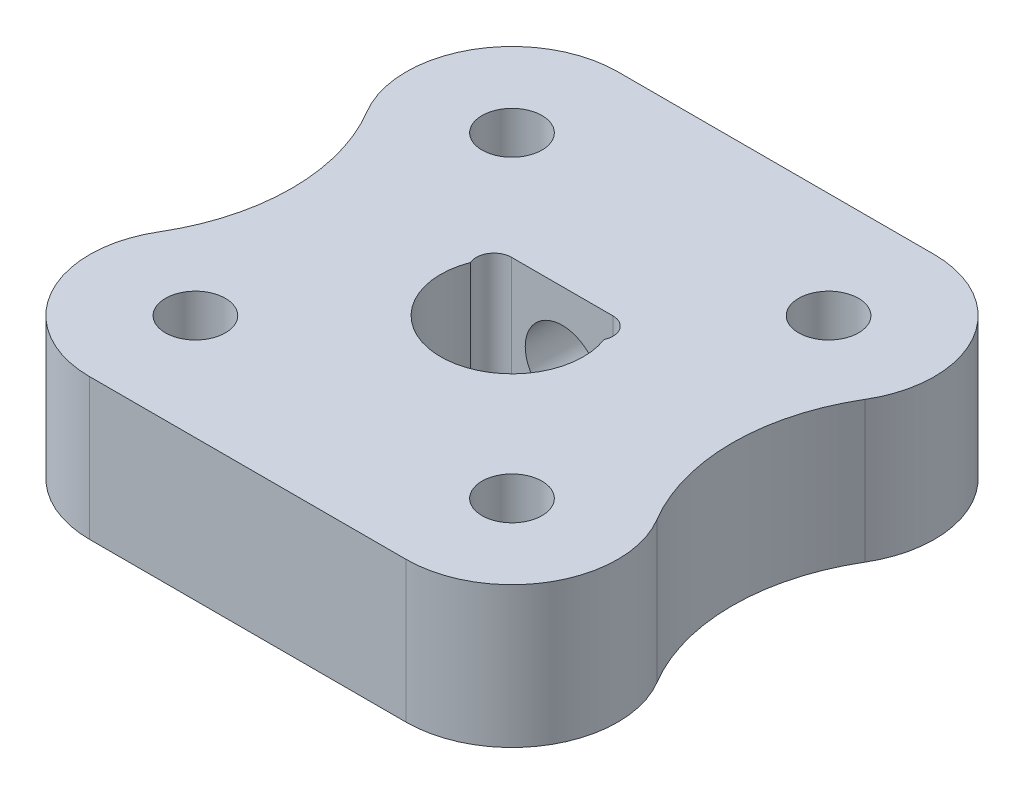
ISO-10303-21;
HEADER;
FILE_DESCRIPTION(('STEP AP214'),'2;1');
FILE_NAME('part.step','',(''),(''),'','','');
FILE_SCHEMA(('AUTOMOTIVE_DESIGN { 1 0 10303 214 1 1 1 1 }'));
ENDSEC;
DATA;
#1=APPLICATION_CONTEXT('core data for automotive mechanical design processes');
#2=APPLICATION_PROTOCOL_DEFINITION('international standard','automotive_design',2000,#1);
#3=PRODUCT_CONTEXT('',#1,'mechanical');
#4=PRODUCT('Part','Part','',(#3));
#5=PRODUCT_RELATED_PRODUCT_CATEGORY('part','',(#4));
#6=PRODUCT_DEFINITION_FORMATION('','',#4);
#7=PRODUCT_DEFINITION_CONTEXT('part definition',#1,'design');
#8=PRODUCT_DEFINITION('design','',#6,#7);
#9=PRODUCT_DEFINITION_SHAPE('','',#8);
#10=(LENGTH_UNIT() NAMED_UNIT(*) SI_UNIT(.MILLI.,.METRE.));
#11=(NAMED_UNIT(*) PLANE_ANGLE_UNIT() SI_UNIT($,.RADIAN.));
#12=(NAMED_UNIT(*) SI_UNIT($,.STERADIAN.) SOLID_ANGLE_UNIT());
#13=UNCERTAINTY_MEASURE_WITH_UNIT(LENGTH_MEASURE(1.E-05),#10,'distance_accuracy_value','');
#14=(GEOMETRIC_REPRESENTATION_CONTEXT(3) GLOBAL_UNCERTAINTY_ASSIGNED_CONTEXT((#13)) GLOBAL_UNIT_ASSIGNED_CONTEXT((#10,
#11,#12)) REPRESENTATION_CONTEXT('',''));
#15=CARTESIAN_POINT('',(0.,0.,0.));
#16=DIRECTION('',(0.,0.,1.));
#17=DIRECTION('',(1.,0.,0.));
#18=AXIS2_PLACEMENT_3D('',#15,#16,#17);
#19=CARTESIAN_POINT('',(11.9987608324787,4.,0.));
#20=DIRECTION('',(0.,-1.,0.));
#21=DIRECTION('',(0.,0.,-1.));
#22=AXIS2_PLACEMENT_3D('',#19,#20,#21);
#23=CYLINDRICAL_SURFACE('',#22,5.74876083247874);
#24=CARTESIAN_POINT('',(11.9987608324787,0.,0.));
#25=DIRECTION('',(0.,1.,0.));
#26=DIRECTION('',(0.,0.,1.));
#27=AXIS2_PLACEMENT_3D('',#24,#25,#26);
#28=CIRCLE('',#27,5.74876083247874);
#29=CARTESIAN_POINT('',(7.06488107380792,0.,2.95043753298049));
#30=VERTEX_POINT('',#29);
#31=CARTESIAN_POINT('',(7.06488107380792,0.,-2.9504375329805));
#32=VERTEX_POINT('',#31);
#33=EDGE_CURVE('E191',#30,#32,#28,.F.);
#34=ORIENTED_EDGE('',*,*,#33,.T.);
#35=DIRECTION('',(0.,-1.,0.));
#36=VECTOR('',#35,1.);
#37=CARTESIAN_POINT('',(7.06488107380792,4.,-2.9504375329805));
#38=LINE('',#37,#36);
#39=CARTESIAN_POINT('',(7.06488107380792,4.,-2.9504375329805));
#40=VERTEX_POINT('',#39);
#41=EDGE_CURVE('E12',#40,#32,#38,.T.);
#42=ORIENTED_EDGE('',*,*,#41,.F.);
#43=CARTESIAN_POINT('',(11.9987608324787,4.,0.));
#44=DIRECTION('',(0.,1.,0.));
#45=DIRECTION('',(0.,0.,1.));
#46=AXIS2_PLACEMENT_3D('',#43,#44,#45);
#47=CIRCLE('',#46,5.74876083247874);
#48=CARTESIAN_POINT('',(7.06488107380792,4.,2.95043753298049));
#49=VERTEX_POINT('',#48);
#50=EDGE_CURVE('E336',#49,#40,#47,.F.);
#51=ORIENTED_EDGE('',*,*,#50,.F.);
#52=DIRECTION('',(0.,-1.,0.));
#53=VECTOR('',#52,1.);
#54=CARTESIAN_POINT('',(7.06488107380792,4.,2.95043753298049));
#55=LINE('',#54,#53);
#56=EDGE_CURVE('E228',#49,#30,#55,.T.);
#57=ORIENTED_EDGE('',*,*,#56,.T.);
#58=EDGE_LOOP('',(#34,#42,#51,#57));
#59=FACE_BOUND('',#58,.T.);
#60=ADVANCED_FACE('F42',(#59),#23,.F.);
#61=CARTESIAN_POINT('',(4.49012806053457,4.,-4.49012806053458));
#62=DIRECTION('',(0.,-1.,0.));
#63=DIRECTION('',(0.,0.,-1.));
#64=AXIS2_PLACEMENT_3D('',#61,#62,#63);
#65=CYLINDRICAL_SURFACE('',#64,3.);
#66=CARTESIAN_POINT('',(4.49012806053457,0.,-4.49012806053458));
#67=DIRECTION('',(0.,1.,0.));
#68=DIRECTION('',(0.,0.,1.));
#69=AXIS2_PLACEMENT_3D('',#66,#67,#68);
#70=CIRCLE('',#69,3.);
#71=CARTESIAN_POINT('',(4.49012806053457,0.,-7.49012806053458));
#72=VERTEX_POINT('',#71);
#73=EDGE_CURVE('E194',#72,#32,#70,.F.);
#74=ORIENTED_EDGE('',*,*,#73,.F.);
#75=DIRECTION('',(0.,-1.,0.));
#76=VECTOR('',#75,1.);
#77=CARTESIAN_POINT('',(4.49012806053457,4.,-7.49012806053458));
#78=LINE('',#77,#76);
#79=CARTESIAN_POINT('',(4.49012806053457,4.,-7.49012806053458));
#80=VERTEX_POINT('',#79);
#81=EDGE_CURVE('E52',#80,#72,#78,.T.);
#82=ORIENTED_EDGE('',*,*,#81,.F.);
#83=CARTESIAN_POINT('',(4.49012806053457,4.,-4.49012806053458));
#84=DIRECTION('',(0.,1.,0.));
#85=DIRECTION('',(0.,0.,1.));
#86=AXIS2_PLACEMENT_3D('',#83,#84,#85);
#87=CIRCLE('',#86,3.);
#88=EDGE_CURVE('E334',#80,#40,#87,.F.);
#89=ORIENTED_EDGE('',*,*,#88,.T.);
#90=ORIENTED_EDGE('',*,*,#41,.T.);
#91=EDGE_LOOP('',(#74,#82,#89,#90));
#92=FACE_BOUND('',#91,.T.);
#93=ADVANCED_FACE('F274',(#92),#65,.T.);
#94=CARTESIAN_POINT('',(0.,4.,-7.49012806053458));
#95=DIRECTION('',(0.,0.,-1.));
#96=DIRECTION('',(-1.,0.,0.));
#97=AXIS2_PLACEMENT_3D('',#94,#95,#96);
#98=PLANE('',#97);
#99=CARTESIAN_POINT('',(0.,2.,-7.49012806053458));
#100=DIRECTION('',(0.,0.,1.));
#101=DIRECTION('',(1.,0.,0.));
#102=AXIS2_PLACEMENT_3D('',#99,#100,#101);
#103=CIRCLE('',#102,1.05);
#104=CARTESIAN_POINT('',(1.05,2.,-7.49012806053458));
#105=VERTEX_POINT('',#104);
#106=EDGE_CURVE('E320',#105,#105,#103,.T.);
#107=ORIENTED_EDGE('',*,*,#106,.T.);
#108=EDGE_LOOP('',(#107));
#109=FACE_BOUND('',#108,.T.);
#110=DIRECTION('',(1.,0.,0.));
#111=VECTOR('',#110,1.);
#112=CARTESIAN_POINT('',(0.,0.,-7.49012806053458));
#113=LINE('',#112,#111);
#114=CARTESIAN_POINT('',(-4.49012806053457,0.,-7.49012806053458));
#115=VERTEX_POINT('',#114);
#116=EDGE_CURVE('E197',#115,#72,#113,.T.);
#117=ORIENTED_EDGE('',*,*,#116,.F.);
#118=DIRECTION('',(0.,-1.,0.));
#119=VECTOR('',#118,1.);
#120=CARTESIAN_POINT('',(-4.49012806053457,4.,-7.49012806053458));
#121=LINE('',#120,#119);
#122=CARTESIAN_POINT('',(-4.49012806053457,4.,-7.49012806053458));
#123=VERTEX_POINT('',#122);
#124=EDGE_CURVE('E234',#123,#115,#121,.T.);
#125=ORIENTED_EDGE('',*,*,#124,.F.);
#126=DIRECTION('',(1.,0.,0.));
#127=VECTOR('',#126,1.);
#128=CARTESIAN_POINT('',(0.,4.,-7.49012806053458));
#129=LINE('',#128,#127);
#130=EDGE_CURVE('E331',#123,#80,#129,.T.);
#131=ORIENTED_EDGE('',*,*,#130,.T.);
#132=ORIENTED_EDGE('',*,*,#81,.T.);
#133=EDGE_LOOP('',(#117,#125,#131,#132));
#134=FACE_BOUND('',#133,.T.);
#135=ADVANCED_FACE('F280',(#109,#134),#98,.T.);
#136=CARTESIAN_POINT('',(-4.49012806053457,4.,-4.49012806053458));
#137=DIRECTION('',(0.,-1.,0.));
#138=DIRECTION('',(0.,0.,-1.));
#139=AXIS2_PLACEMENT_3D('',#136,#137,#138);
#140=CYLINDRICAL_SURFACE('',#139,3.);
#141=CARTESIAN_POINT('',(-4.49012806053457,0.,-4.49012806053458));
#142=DIRECTION('',(0.,1.,0.));
#143=DIRECTION('',(0.,0.,1.));
#144=AXIS2_PLACEMENT_3D('',#141,#142,#143);
#145=CIRCLE('',#144,3.);
#146=CARTESIAN_POINT('',(-7.06488107380792,0.,-2.95043753298049));
#147=VERTEX_POINT('',#146);
#148=EDGE_CURVE('E202',#115,#147,#145,.T.);
#149=ORIENTED_EDGE('',*,*,#148,.T.);
#150=DIRECTION('',(0.,-1.,0.));
#151=VECTOR('',#150,1.);
#152=CARTESIAN_POINT('',(-7.06488107380792,4.,-2.95043753298049));
#153=LINE('',#152,#151);
#154=CARTESIAN_POINT('',(-7.06488107380792,4.,-2.95043753298049));
#155=VERTEX_POINT('',#154);
#156=EDGE_CURVE('E232',#155,#147,#153,.T.);
#157=ORIENTED_EDGE('',*,*,#156,.F.);
#158=CARTESIAN_POINT('',(-4.49012806053457,4.,-4.49012806053458));
#159=DIRECTION('',(0.,1.,0.));
#160=DIRECTION('',(0.,0.,1.));
#161=AXIS2_PLACEMENT_3D('',#158,#159,#160);
#162=CIRCLE('',#161,3.);
#163=EDGE_CURVE('E160',#123,#155,#162,.T.);
#164=ORIENTED_EDGE('',*,*,#163,.F.);
#165=ORIENTED_EDGE('',*,*,#124,.T.);
#166=EDGE_LOOP('',(#149,#157,#164,#165));
#167=FACE_BOUND('',#166,.T.);
#168=ADVANCED_FACE('F309',(#167),#140,.T.);
#169=CARTESIAN_POINT('',(-11.9987608324787,4.,0.));
#170=DIRECTION('',(0.,-1.,0.));
#171=DIRECTION('',(0.,0.,-1.));
#172=AXIS2_PLACEMENT_3D('',#169,#170,#171);
#173=CYLINDRICAL_SURFACE('',#172,5.74876083247874);
#174=CARTESIAN_POINT('',(-11.9987608324787,0.,0.));
#175=DIRECTION('',(0.,1.,0.));
#176=DIRECTION('',(0.,0.,1.));
#177=AXIS2_PLACEMENT_3D('',#174,#175,#176);
#178=CIRCLE('',#177,5.74876083247874);
#179=CARTESIAN_POINT('',(-7.06488107380792,0.,2.95043753298049));
#180=VERTEX_POINT('',#179);
#181=EDGE_CURVE('E205',#180,#147,#178,.T.);
#182=ORIENTED_EDGE('',*,*,#181,.F.);
#183=DIRECTION('',(0.,-1.,0.));
#184=VECTOR('',#183,1.);
#185=CARTESIAN_POINT('',(-7.06488107380792,4.,2.95043753298049));
#186=LINE('',#185,#184);
#187=CARTESIAN_POINT('',(-7.06488107380792,4.,2.95043753298049));
#188=VERTEX_POINT('',#187);
#189=EDGE_CURVE('E148',#188,#180,#186,.T.);
#190=ORIENTED_EDGE('',*,*,#189,.F.);
#191=CARTESIAN_POINT('',(-11.9987608324787,4.,0.));
#192=DIRECTION('',(0.,1.,0.));
#193=DIRECTION('',(0.,0.,1.));
#194=AXIS2_PLACEMENT_3D('',#191,#192,#193);
#195=CIRCLE('',#194,5.74876083247874);
#196=EDGE_CURVE('E158',#188,#155,#195,.T.);
#197=ORIENTED_EDGE('',*,*,#196,.T.);
#198=ORIENTED_EDGE('',*,*,#156,.T.);
#199=EDGE_LOOP('',(#182,#190,#197,#198));
#200=FACE_BOUND('',#199,.T.);
#201=ADVANCED_FACE('F306',(#200),#173,.F.);
#202=CARTESIAN_POINT('',(-4.49012806053457,4.,4.49012806053458));
#203=DIRECTION('',(0.,-1.,0.));
#204=DIRECTION('',(0.,0.,-1.));
#205=AXIS2_PLACEMENT_3D('',#202,#203,#204);
#206=CYLINDRICAL_SURFACE('',#205,3.);
#207=CARTESIAN_POINT('',(-4.49012806053457,0.,4.49012806053458));
#208=DIRECTION('',(0.,1.,0.));
#209=DIRECTION('',(0.,0.,1.));
#210=AXIS2_PLACEMENT_3D('',#207,#208,#209);
#211=CIRCLE('',#210,3.);
#212=CARTESIAN_POINT('',(-4.49012806053457,0.,7.49012806053458));
#213=VERTEX_POINT('',#212);
#214=EDGE_CURVE('E147',#213,#180,#211,.F.);
#215=ORIENTED_EDGE('',*,*,#214,.F.);
#216=DIRECTION('',(0.,-1.,0.));
#217=VECTOR('',#216,1.);
#218=CARTESIAN_POINT('',(-4.49012806053457,4.,7.49012806053458));
#219=LINE('',#218,#217);
#220=CARTESIAN_POINT('',(-4.49012806053457,4.,7.49012806053458));
#221=VERTEX_POINT('',#220);
#222=EDGE_CURVE('E141',#221,#213,#219,.T.);
#223=ORIENTED_EDGE('',*,*,#222,.F.);
#224=CARTESIAN_POINT('',(-4.49012806053457,4.,4.49012806053458));
#225=DIRECTION('',(0.,1.,0.));
#226=DIRECTION('',(0.,0.,1.));
#227=AXIS2_PLACEMENT_3D('',#224,#225,#226);
#228=CIRCLE('',#227,3.);
#229=EDGE_CURVE('E145',#221,#188,#228,.F.);
#230=ORIENTED_EDGE('',*,*,#229,.T.);
#231=ORIENTED_EDGE('',*,*,#189,.T.);
#232=EDGE_LOOP('',(#215,#223,#230,#231));
#233=FACE_BOUND('',#232,.T.);
#234=ADVANCED_FACE('F143',(#233),#206,.T.);
#235=CARTESIAN_POINT('',(0.,4.,7.49012806053458));
#236=DIRECTION('',(0.,0.,-1.));
#237=DIRECTION('',(-1.,0.,0.));
#238=AXIS2_PLACEMENT_3D('',#235,#236,#237);
#239=PLANE('',#238);
#240=DIRECTION('',(1.,0.,0.));
#241=VECTOR('',#240,1.);
#242=CARTESIAN_POINT('',(0.,0.,7.49012806053458));
#243=LINE('',#242,#241);
#244=CARTESIAN_POINT('',(4.49012806053457,0.,7.49012806053458));
#245=VERTEX_POINT('',#244);
#246=EDGE_CURVE('E100',#213,#245,#243,.T.);
#247=ORIENTED_EDGE('',*,*,#246,.T.);
#248=DIRECTION('',(0.,-1.,0.));
#249=VECTOR('',#248,1.);
#250=CARTESIAN_POINT('',(4.49012806053457,4.,7.49012806053458));
#251=LINE('',#250,#249);
#252=CARTESIAN_POINT('',(4.49012806053457,4.,7.49012806053458));
#253=VERTEX_POINT('',#252);
#254=EDGE_CURVE('E149',#253,#245,#251,.T.);
#255=ORIENTED_EDGE('',*,*,#254,.F.);
#256=DIRECTION('',(1.,0.,0.));
#257=VECTOR('',#256,1.);
#258=CARTESIAN_POINT('',(0.,4.,7.49012806053458));
#259=LINE('',#258,#257);
#260=EDGE_CURVE('E151',#221,#253,#259,.T.);
#261=ORIENTED_EDGE('',*,*,#260,.F.);
#262=ORIENTED_EDGE('',*,*,#222,.T.);
#263=EDGE_LOOP('',(#247,#255,#261,#262));
#264=FACE_BOUND('',#263,.T.);
#265=ADVANCED_FACE('F152',(#264),#239,.F.);
#266=CARTESIAN_POINT('',(-1.43874945699382,4.,-0.925));
#267=DIRECTION('',(0.,-1.,0.));
#268=DIRECTION('',(0.,0.,-1.));
#269=AXIS2_PLACEMENT_3D('',#266,#267,#268);
#270=CYLINDRICAL_SURFACE('',#269,0.5);
#271=CARTESIAN_POINT('',(-1.43874945699382,0.,-0.925));
#272=DIRECTION('',(0.,1.,0.));
#273=DIRECTION('',(0.,0.,1.));
#274=AXIS2_PLACEMENT_3D('',#271,#272,#273);
#275=CIRCLE('',#274,0.5);
#276=CARTESIAN_POINT('',(-1.43874945699382,0.,-1.425));
#277=VERTEX_POINT('',#276);
#278=CARTESIAN_POINT('',(-1.8936414023796,0.,-0.717458876308482));
#279=VERTEX_POINT('',#278);
#280=EDGE_CURVE('E178',#277,#279,#275,.T.);
#281=ORIENTED_EDGE('',*,*,#280,.F.);
#282=DIRECTION('',(0.,-1.,0.));
#283=VECTOR('',#282,1.);
#284=CARTESIAN_POINT('',(-1.43874945699382,4.,-1.425));
#285=LINE('',#284,#283);
#286=CARTESIAN_POINT('',(-1.43874945699382,4.,-1.425));
#287=VERTEX_POINT('',#286);
#288=EDGE_CURVE('E46',#287,#277,#285,.T.);
#289=ORIENTED_EDGE('',*,*,#288,.F.);
#290=CARTESIAN_POINT('',(-1.43874945699382,4.,-0.925));
#291=DIRECTION('',(0.,1.,0.));
#292=DIRECTION('',(0.,0.,1.));
#293=AXIS2_PLACEMENT_3D('',#290,#291,#292);
#294=CIRCLE('',#293,0.5);
#295=CARTESIAN_POINT('',(-1.8936414023796,4.,-0.717458876308482));
#296=VERTEX_POINT('',#295);
#297=EDGE_CURVE('E227',#287,#296,#294,.T.);
#298=ORIENTED_EDGE('',*,*,#297,.T.);
#299=DIRECTION('',(0.,-1.,0.));
#300=VECTOR('',#299,1.);
#301=CARTESIAN_POINT('',(-1.8936414023796,4.,-0.717458876308482));
#302=LINE('',#301,#300);
#303=EDGE_CURVE('E177',#296,#279,#302,.T.);
#304=ORIENTED_EDGE('',*,*,#303,.T.);
#305=EDGE_LOOP('',(#281,#289,#298,#304));
#306=FACE_BOUND('',#305,.T.);
#307=ADVANCED_FACE('F44',(#306),#270,.F.);
#308=CARTESIAN_POINT('',(0.,4.,-1.425));
#309=DIRECTION('',(0.,0.,-1.));
#310=DIRECTION('',(-1.,0.,0.));
#311=AXIS2_PLACEMENT_3D('',#308,#309,#310);
#312=PLANE('',#311);
#313=CARTESIAN_POINT('',(0.,2.,-1.425));
#314=DIRECTION('',(0.,0.,-1.));
#315=DIRECTION('',(-1.,0.,0.));
#316=AXIS2_PLACEMENT_3D('',#313,#314,#315);
#317=CIRCLE('',#316,1.05);
#318=CARTESIAN_POINT('',(-1.05,2.,-1.425));
#319=VERTEX_POINT('',#318);
#320=EDGE_CURVE('E182',#319,#319,#317,.T.);
#321=ORIENTED_EDGE('',*,*,#320,.T.);
#322=EDGE_LOOP('',(#321));
#323=FACE_BOUND('',#322,.T.);
#324=DIRECTION('',(1.,0.,0.));
#325=VECTOR('',#324,1.);
#326=CARTESIAN_POINT('',(0.,0.,-1.425));
#327=LINE('',#326,#325);
#328=CARTESIAN_POINT('',(1.43874945699382,0.,-1.425));
#329=VERTEX_POINT('',#328);
#330=EDGE_CURVE('E181',#277,#329,#327,.T.);
#331=ORIENTED_EDGE('',*,*,#330,.T.);
#332=DIRECTION('',(0.,-1.,0.));
#333=VECTOR('',#332,1.);
#334=CARTESIAN_POINT('',(1.43874945699382,4.,-1.425));
#335=LINE('',#334,#333);
#336=CARTESIAN_POINT('',(1.43874945699382,4.,-1.425));
#337=VERTEX_POINT('',#336);
#338=EDGE_CURVE('E239',#337,#329,#335,.T.);
#339=ORIENTED_EDGE('',*,*,#338,.F.);
#340=DIRECTION('',(1.,0.,0.));
#341=VECTOR('',#340,1.);
#342=CARTESIAN_POINT('',(0.,4.,-1.425));
#343=LINE('',#342,#341);
#344=EDGE_CURVE('E248',#287,#337,#343,.T.);
#345=ORIENTED_EDGE('',*,*,#344,.F.);
#346=ORIENTED_EDGE('',*,*,#288,.T.);
#347=EDGE_LOOP('',(#331,#339,#345,#346));
#348=FACE_BOUND('',#347,.T.);
#349=ADVANCED_FACE('F247',(#323,#348),#312,.F.);
#350=CARTESIAN_POINT('',(1.43874945699382,4.,-0.925000000000001));
#351=DIRECTION('',(0.,-1.,0.));
#352=DIRECTION('',(0.,0.,-1.));
#353=AXIS2_PLACEMENT_3D('',#350,#351,#352);
#354=CYLINDRICAL_SURFACE('',#353,0.5);
#355=CARTESIAN_POINT('',(1.43874945699382,0.,-0.925000000000001));
#356=DIRECTION('',(0.,1.,0.));
#357=DIRECTION('',(0.,0.,1.));
#358=AXIS2_PLACEMENT_3D('',#355,#356,#357);
#359=CIRCLE('',#358,0.5);
#360=CARTESIAN_POINT('',(1.8936414023796,0.,-0.717458876308479));
#361=VERTEX_POINT('',#360);
#362=EDGE_CURVE('E185',#329,#361,#359,.F.);
#363=ORIENTED_EDGE('',*,*,#362,.T.);
#364=DIRECTION('',(0.,-1.,0.));
#365=VECTOR('',#364,1.);
#366=CARTESIAN_POINT('',(1.8936414023796,4.,-0.717458876308479));
#367=LINE('',#366,#365);
#368=CARTESIAN_POINT('',(1.8936414023796,4.,-0.717458876308479));
#369=VERTEX_POINT('',#368);
#370=EDGE_CURVE('E238',#369,#361,#367,.T.);
#371=ORIENTED_EDGE('',*,*,#370,.F.);
#372=CARTESIAN_POINT('',(1.43874945699382,4.,-0.925000000000001));
#373=DIRECTION('',(0.,1.,0.));
#374=DIRECTION('',(0.,0.,1.));
#375=AXIS2_PLACEMENT_3D('',#372,#373,#374);
#376=CIRCLE('',#375,0.5);
#377=EDGE_CURVE('E341',#337,#369,#376,.F.);
#378=ORIENTED_EDGE('',*,*,#377,.F.);
#379=ORIENTED_EDGE('',*,*,#338,.T.);
#380=EDGE_LOOP('',(#363,#371,#378,#379));
#381=FACE_BOUND('',#380,.T.);
#382=ADVANCED_FACE('F260',(#381),#354,.F.);
#383=CARTESIAN_POINT('',(-4.49012806053457,4.,-4.49012806053458));
#384=DIRECTION('',(0.,-1.,0.));
#385=DIRECTION('',(0.,0.,-1.));
#386=AXIS2_PLACEMENT_3D('',#383,#384,#385);
#387=CYLINDRICAL_SURFACE('',#386,0.85);
#388=CARTESIAN_POINT('',(-4.49012806053457,4.,-4.49012806053458));
#389=DIRECTION('',(0.,1.,0.));
#390=DIRECTION('',(0.,0.,1.));
#391=AXIS2_PLACEMENT_3D('',#388,#389,#390);
#392=CIRCLE('',#391,0.85);
#393=CARTESIAN_POINT('',(-4.49012806053457,4.,-3.64012806053458));
#394=VERTEX_POINT('',#393);
#395=EDGE_CURVE('E171',#394,#394,#392,.F.);
#396=ORIENTED_EDGE('',*,*,#395,.F.);
#397=EDGE_LOOP('',(#396));
#398=FACE_BOUND('',#397,.T.);
#399=CARTESIAN_POINT('',(-4.49012806053457,0.,-4.49012806053458));
#400=DIRECTION('',(0.,1.,0.));
#401=DIRECTION('',(0.,0.,1.));
#402=AXIS2_PLACEMENT_3D('',#399,#400,#401);
#403=CIRCLE('',#402,0.85);
#404=CARTESIAN_POINT('',(-4.49012806053457,0.,-3.64012806053458));
#405=VERTEX_POINT('',#404);
#406=EDGE_CURVE('E219',#405,#405,#403,.F.);
#407=ORIENTED_EDGE('',*,*,#406,.T.);
#408=EDGE_LOOP('',(#407));
#409=FACE_BOUND('',#408,.T.);
#410=ADVANCED_FACE('F262',(#398,#409),#387,.F.);
#411=CARTESIAN_POINT('',(-4.49012806053457,4.,4.49012806053458));
#412=DIRECTION('',(0.,-1.,0.));
#413=DIRECTION('',(0.,0.,-1.));
#414=AXIS2_PLACEMENT_3D('',#411,#412,#413);
#415=CYLINDRICAL_SURFACE('',#414,0.85);
#416=CARTESIAN_POINT('',(-4.49012806053457,4.,4.49012806053458));
#417=DIRECTION('',(0.,1.,0.));
#418=DIRECTION('',(0.,0.,1.));
#419=AXIS2_PLACEMENT_3D('',#416,#417,#418);
#420=CIRCLE('',#419,0.85);
#421=CARTESIAN_POINT('',(-4.49012806053457,4.,5.34012806053458));
#422=VERTEX_POINT('',#421);
#423=EDGE_CURVE('E168',#422,#422,#420,.T.);
#424=ORIENTED_EDGE('',*,*,#423,.T.);
#425=EDGE_LOOP('',(#424));
#426=FACE_BOUND('',#425,.T.);
#427=CARTESIAN_POINT('',(-4.49012806053457,0.,4.49012806053458));
#428=DIRECTION('',(0.,1.,0.));
#429=DIRECTION('',(0.,0.,1.));
#430=AXIS2_PLACEMENT_3D('',#427,#428,#429);
#431=CIRCLE('',#430,0.85);
#432=CARTESIAN_POINT('',(-4.49012806053457,0.,5.34012806053458));
#433=VERTEX_POINT('',#432);
#434=EDGE_CURVE('E215',#433,#433,#431,.T.);
#435=ORIENTED_EDGE('',*,*,#434,.F.);
#436=EDGE_LOOP('',(#435));
#437=FACE_BOUND('',#436,.T.);
#438=ADVANCED_FACE('F268',(#426,#437),#415,.F.);
#439=CARTESIAN_POINT('',(4.49012806053457,4.,4.49012806053458));
#440=DIRECTION('',(0.,-1.,0.));
#441=DIRECTION('',(0.,0.,-1.));
#442=AXIS2_PLACEMENT_3D('',#439,#440,#441);
#443=CYLINDRICAL_SURFACE('',#442,0.85);
#444=CARTESIAN_POINT('',(4.49012806053457,4.,4.49012806053458));
#445=DIRECTION('',(0.,1.,0.));
#446=DIRECTION('',(0.,0.,1.));
#447=AXIS2_PLACEMENT_3D('',#444,#445,#446);
#448=CIRCLE('',#447,0.85);
#449=CARTESIAN_POINT('',(4.49012806053457,4.,5.34012806053458));
#450=VERTEX_POINT('',#449);
#451=EDGE_CURVE('E165',#450,#450,#448,.F.);
#452=ORIENTED_EDGE('',*,*,#451,.F.);
#453=EDGE_LOOP('',(#452));
#454=FACE_BOUND('',#453,.T.);
#455=CARTESIAN_POINT('',(4.49012806053457,0.,4.49012806053458));
#456=DIRECTION('',(0.,1.,0.));
#457=DIRECTION('',(0.,0.,1.));
#458=AXIS2_PLACEMENT_3D('',#455,#456,#457);
#459=CIRCLE('',#458,0.85);
#460=CARTESIAN_POINT('',(4.49012806053457,0.,5.34012806053458));
#461=VERTEX_POINT('',#460);
#462=EDGE_CURVE('E211',#461,#461,#459,.F.);
#463=ORIENTED_EDGE('',*,*,#462,.T.);
#464=EDGE_LOOP('',(#463));
#465=FACE_BOUND('',#464,.T.);
#466=ADVANCED_FACE('F293',(#454,#465),#443,.F.);
#467=CARTESIAN_POINT('',(4.49012806053457,4.,4.49012806053458));
#468=DIRECTION('',(0.,-1.,0.));
#469=DIRECTION('',(0.,0.,-1.));
#470=AXIS2_PLACEMENT_3D('',#467,#468,#469);
#471=CYLINDRICAL_SURFACE('',#470,3.);
#472=CARTESIAN_POINT('',(4.49012806053457,0.,4.49012806053458));
#473=DIRECTION('',(0.,1.,0.));
#474=DIRECTION('',(0.,0.,1.));
#475=AXIS2_PLACEMENT_3D('',#472,#473,#474);
#476=CIRCLE('',#475,3.);
#477=EDGE_CURVE('E106',#245,#30,#476,.T.);
#478=ORIENTED_EDGE('',*,*,#477,.T.);
#479=ORIENTED_EDGE('',*,*,#56,.F.);
#480=CARTESIAN_POINT('',(4.49012806053457,4.,4.49012806053458));
#481=DIRECTION('',(0.,1.,0.));
#482=DIRECTION('',(0.,0.,1.));
#483=AXIS2_PLACEMENT_3D('',#480,#481,#482);
#484=CIRCLE('',#483,3.);
#485=EDGE_CURVE('E61',#253,#49,#484,.T.);
#486=ORIENTED_EDGE('',*,*,#485,.F.);
#487=ORIENTED_EDGE('',*,*,#254,.T.);
#488=EDGE_LOOP('',(#478,#479,#486,#487));
#489=FACE_BOUND('',#488,.T.);
#490=ADVANCED_FACE('F286',(#489),#471,.T.);
#491=CARTESIAN_POINT('',(0.,4.,0.));
#492=DIRECTION('',(0.,-1.,0.));
#493=DIRECTION('',(0.,0.,-1.));
#494=AXIS2_PLACEMENT_3D('',#491,#492,#493);
#495=CYLINDRICAL_SURFACE('',#494,2.025);
#496=CARTESIAN_POINT('',(0.,0.,0.));
#497=DIRECTION('',(0.,1.,0.));
#498=DIRECTION('',(0.,0.,1.));
#499=AXIS2_PLACEMENT_3D('',#496,#497,#498);
#500=CIRCLE('',#499,2.025);
#501=EDGE_CURVE('E188',#279,#361,#500,.T.);
#502=ORIENTED_EDGE('',*,*,#501,.F.);
#503=ORIENTED_EDGE('',*,*,#303,.F.);
#504=CARTESIAN_POINT('',(0.,4.,0.));
#505=DIRECTION('',(0.,1.,0.));
#506=DIRECTION('',(0.,0.,1.));
#507=AXIS2_PLACEMENT_3D('',#504,#505,#506);
#508=CIRCLE('',#507,2.025);
#509=EDGE_CURVE('E258',#296,#369,#508,.T.);
#510=ORIENTED_EDGE('',*,*,#509,.T.);
#511=ORIENTED_EDGE('',*,*,#370,.T.);
#512=EDGE_LOOP('',(#502,#503,#510,#511));
#513=FACE_BOUND('',#512,.T.);
#514=ADVANCED_FACE('F257',(#513),#495,.F.);
#515=CARTESIAN_POINT('',(4.49012806053457,4.,-4.49012806053458));
#516=DIRECTION('',(0.,-1.,0.));
#517=DIRECTION('',(0.,0.,-1.));
#518=AXIS2_PLACEMENT_3D('',#515,#516,#517);
#519=CYLINDRICAL_SURFACE('',#518,0.85);
#520=CARTESIAN_POINT('',(4.49012806053457,4.,-4.49012806053458));
#521=DIRECTION('',(0.,1.,0.));
#522=DIRECTION('',(0.,0.,1.));
#523=AXIS2_PLACEMENT_3D('',#520,#521,#522);
#524=CIRCLE('',#523,0.85);
#525=CARTESIAN_POINT('',(4.49012806053457,4.,-3.64012806053459));
#526=VERTEX_POINT('',#525);
#527=EDGE_CURVE('E174',#526,#526,#524,.T.);
#528=ORIENTED_EDGE('',*,*,#527,.T.);
#529=EDGE_LOOP('',(#528));
#530=FACE_BOUND('',#529,.T.);
#531=CARTESIAN_POINT('',(4.49012806053457,0.,-4.49012806053458));
#532=DIRECTION('',(0.,1.,0.));
#533=DIRECTION('',(0.,0.,1.));
#534=AXIS2_PLACEMENT_3D('',#531,#532,#533);
#535=CIRCLE('',#534,0.85);
#536=CARTESIAN_POINT('',(4.49012806053457,0.,-3.64012806053459));
#537=VERTEX_POINT('',#536);
#538=EDGE_CURVE('E223',#537,#537,#535,.T.);
#539=ORIENTED_EDGE('',*,*,#538,.F.);
#540=EDGE_LOOP('',(#539));
#541=FACE_BOUND('',#540,.T.);
#542=ADVANCED_FACE('F285',(#530,#541),#519,.F.);
#543=CARTESIAN_POINT('',(0.,4.,0.));
#544=DIRECTION('',(0.,1.,0.));
#545=DIRECTION('',(0.,0.,1.));
#546=AXIS2_PLACEMENT_3D('',#543,#544,#545);
#547=PLANE('',#546);
#548=ORIENTED_EDGE('',*,*,#297,.F.);
#549=ORIENTED_EDGE('',*,*,#344,.T.);
#550=ORIENTED_EDGE('',*,*,#377,.T.);
#551=ORIENTED_EDGE('',*,*,#509,.F.);
#552=EDGE_LOOP('',(#548,#549,#550,#551));
#553=FACE_BOUND('',#552,.T.);
#554=ORIENTED_EDGE('',*,*,#50,.T.);
#555=ORIENTED_EDGE('',*,*,#88,.F.);
#556=ORIENTED_EDGE('',*,*,#130,.F.);
#557=ORIENTED_EDGE('',*,*,#163,.T.);
#558=ORIENTED_EDGE('',*,*,#196,.F.);
#559=ORIENTED_EDGE('',*,*,#229,.F.);
#560=ORIENTED_EDGE('',*,*,#260,.T.);
#561=ORIENTED_EDGE('',*,*,#485,.T.);
#562=EDGE_LOOP('',(#554,#555,#556,#557,#558,#559,#560,#561));
#563=FACE_BOUND('',#562,.T.);
#564=ORIENTED_EDGE('',*,*,#451,.T.);
#565=EDGE_LOOP('',(#564));
#566=FACE_BOUND('',#565,.T.);
#567=ORIENTED_EDGE('',*,*,#423,.F.);
#568=EDGE_LOOP('',(#567));
#569=FACE_BOUND('',#568,.T.);
#570=ORIENTED_EDGE('',*,*,#395,.T.);
#571=EDGE_LOOP('',(#570));
#572=FACE_BOUND('',#571,.T.);
#573=ORIENTED_EDGE('',*,*,#527,.F.);
#574=EDGE_LOOP('',(#573));
#575=FACE_BOUND('',#574,.T.);
#576=ADVANCED_FACE('F155',(#553,#563,#566,#569,#572,#575),#547,.T.);
#577=CARTESIAN_POINT('',(0.,0.,0.));
#578=DIRECTION('',(0.,1.,0.));
#579=DIRECTION('',(0.,0.,1.));
#580=AXIS2_PLACEMENT_3D('',#577,#578,#579);
#581=PLANE('',#580);
#582=ORIENTED_EDGE('',*,*,#280,.T.);
#583=ORIENTED_EDGE('',*,*,#501,.T.);
#584=ORIENTED_EDGE('',*,*,#362,.F.);
#585=ORIENTED_EDGE('',*,*,#330,.F.);
#586=EDGE_LOOP('',(#582,#583,#584,#585));
#587=FACE_BOUND('',#586,.T.);
#588=ORIENTED_EDGE('',*,*,#33,.F.);
#589=ORIENTED_EDGE('',*,*,#477,.F.);
#590=ORIENTED_EDGE('',*,*,#246,.F.);
#591=ORIENTED_EDGE('',*,*,#214,.T.);
#592=ORIENTED_EDGE('',*,*,#181,.T.);
#593=ORIENTED_EDGE('',*,*,#148,.F.);
#594=ORIENTED_EDGE('',*,*,#116,.T.);
#595=ORIENTED_EDGE('',*,*,#73,.T.);
#596=EDGE_LOOP('',(#588,#589,#590,#591,#592,#593,#594,#595));
#597=FACE_BOUND('',#596,.T.);
#598=ORIENTED_EDGE('',*,*,#462,.F.);
#599=EDGE_LOOP('',(#598));
#600=FACE_BOUND('',#599,.T.);
#601=ORIENTED_EDGE('',*,*,#434,.T.);
#602=EDGE_LOOP('',(#601));
#603=FACE_BOUND('',#602,.T.);
#604=ORIENTED_EDGE('',*,*,#406,.F.);
#605=EDGE_LOOP('',(#604));
#606=FACE_BOUND('',#605,.T.);
#607=ORIENTED_EDGE('',*,*,#538,.T.);
#608=EDGE_LOOP('',(#607));
#609=FACE_BOUND('',#608,.T.);
#610=ADVANCED_FACE('F251',(#587,#597,#600,#603,#606,#609),#581,.F.);
#611=CARTESIAN_POINT('',(0.,2.,7.49112806053459));
#612=DIRECTION('',(0.,0.,-1.));
#613=DIRECTION('',(-1.,0.,0.));
#614=AXIS2_PLACEMENT_3D('',#611,#612,#613);
#615=CYLINDRICAL_SURFACE('',#614,1.05);
#616=ORIENTED_EDGE('',*,*,#106,.F.);
#617=EDGE_LOOP('',(#616));
#618=FACE_BOUND('',#617,.T.);
#619=ORIENTED_EDGE('',*,*,#320,.F.);
#620=EDGE_LOOP('',(#619));
#621=FACE_BOUND('',#620,.T.);
#622=ADVANCED_FACE('F350',(#618,#621),#615,.F.);
#623=CLOSED_SHELL('',(#60,#93,#135,#168,#201,#234,#265,#307,#349,#382,#410,#438,#466,#490,#514,
#542,#576,#610,#622));
#624=MANIFOLD_SOLID_BREP('B2',#623);
#625=ADVANCED_BREP_SHAPE_REPRESENTATION('',(#18,#624),#14);
#626=SHAPE_DEFINITION_REPRESENTATION(#9,#625);
ENDSEC;
END-ISO-10303-21;
